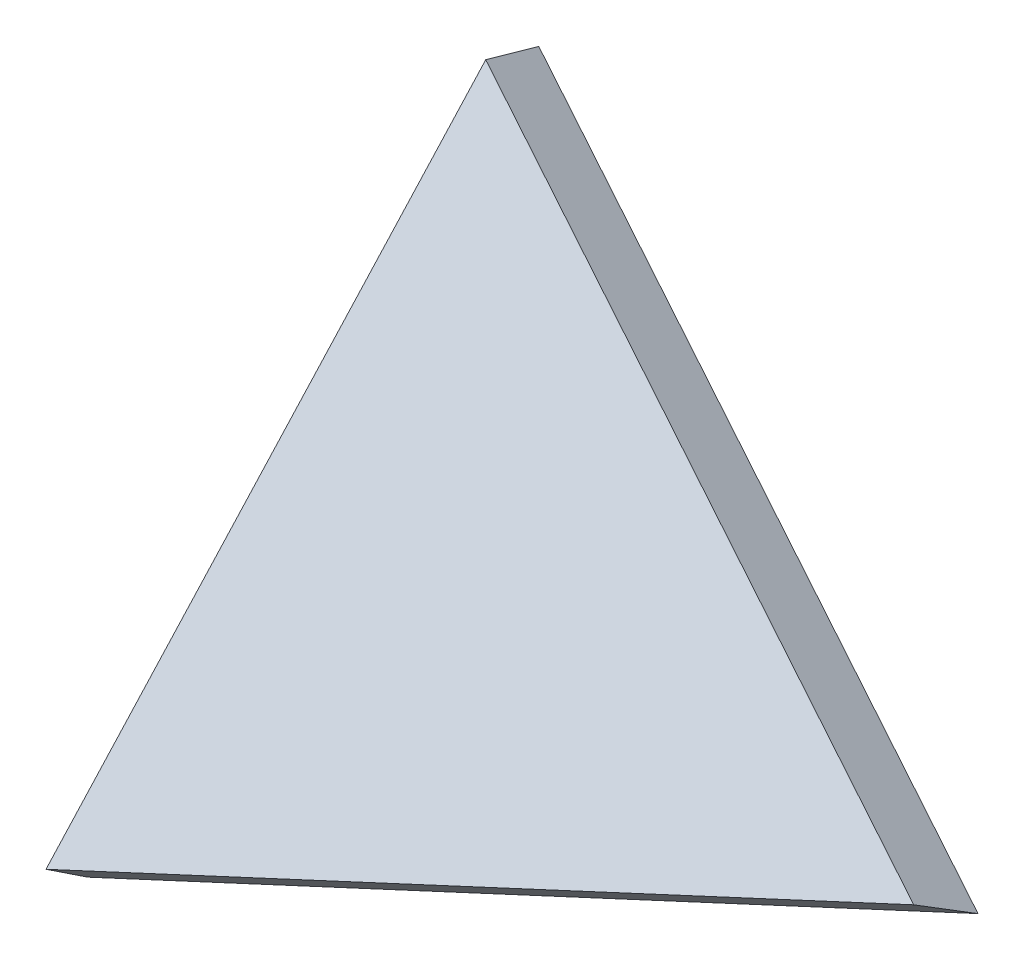
ISO-10303-21;
HEADER;
FILE_DESCRIPTION(('STEP AP214'),'2;1');
FILE_NAME('part.step','',(''),(''),'','','');
FILE_SCHEMA(('AUTOMOTIVE_DESIGN { 1 0 10303 214 1 1 1 1 }'));
ENDSEC;
DATA;
#1=APPLICATION_CONTEXT('core data for automotive mechanical design processes');
#2=APPLICATION_PROTOCOL_DEFINITION('international standard','automotive_design',2000,#1);
#3=PRODUCT_CONTEXT('',#1,'mechanical');
#4=PRODUCT('Part','Part','',(#3));
#5=PRODUCT_RELATED_PRODUCT_CATEGORY('part','',(#4));
#6=PRODUCT_DEFINITION_FORMATION('','',#4);
#7=PRODUCT_DEFINITION_CONTEXT('part definition',#1,'design');
#8=PRODUCT_DEFINITION('design','',#6,#7);
#9=PRODUCT_DEFINITION_SHAPE('','',#8);
#10=(LENGTH_UNIT() NAMED_UNIT(*) SI_UNIT(.MILLI.,.METRE.));
#11=(NAMED_UNIT(*) PLANE_ANGLE_UNIT() SI_UNIT($,.RADIAN.));
#12=(NAMED_UNIT(*) SI_UNIT($,.STERADIAN.) SOLID_ANGLE_UNIT());
#13=UNCERTAINTY_MEASURE_WITH_UNIT(LENGTH_MEASURE(1.E-05),#10,'distance_accuracy_value','');
#14=(GEOMETRIC_REPRESENTATION_CONTEXT(3) GLOBAL_UNCERTAINTY_ASSIGNED_CONTEXT((#13)) GLOBAL_UNIT_ASSIGNED_CONTEXT((#10,
#11,#12)) REPRESENTATION_CONTEXT('',''));
#15=CARTESIAN_POINT('',(0.,0.,0.));
#16=DIRECTION('',(0.,0.,1.));
#17=DIRECTION('',(1.,0.,0.));
#18=AXIS2_PLACEMENT_3D('',#15,#16,#17);
#19=CARTESIAN_POINT('',(1.64832448490546,203.403025611015,386.525464938519));
#20=DIRECTION('',(-0.00377380276404069,-0.465686766952991,-0.884941576318781));
#21=DIRECTION('',(0.,0.884947877872447,-0.465690083047785));
#22=AXIS2_PLACEMENT_3D('',#19,#20,#21);
#23=PLANE('',#22);
#24=DIRECTION('',(-0.844161253265809,0.475886304076224,-0.246827883508674));
#25=VECTOR('',#24,1.);
#26=CARTESIAN_POINT('',(-7635.13298924673,-5561.17680593782,3452.61290351664));
#27=LINE('',#26,#25);
#28=CARTESIAN_POINT('',(-6922.01558613949,-5963.18863012929,3661.1243207621));
#29=VERTEX_POINT('',#28);
#30=CARTESIAN_POINT('',(-7626.49227625021,-5566.04790960029,3455.13939817946));
#31=VERTEX_POINT('',#30);
#32=EDGE_CURVE('E70',#29,#31,#27,.T.);
#33=ORIENTED_EDGE('',*,*,#32,.T.);
#34=DIRECTION('',(-0.175952847890339,-0.870832024405516,0.459012179129346));
#35=VECTOR('',#34,1.);
#36=CARTESIAN_POINT('',(-7769.1836891903,-6272.26127008732,3827.381718676));
#37=LINE('',#36,#35);
#38=CARTESIAN_POINT('',(-7768.40823289946,-6268.42335453389,3825.35876828818));
#39=VERTEX_POINT('',#38);
#40=EDGE_CURVE('E42',#31,#39,#37,.T.);
#41=ORIENTED_EDGE('',*,*,#40,.T.);
#42=DIRECTION('',(0.92540805447083,0.333730064349569,-0.179566636293456));
#43=VECTOR('',#42,1.);
#44=CARTESIAN_POINT('',(-6910.74723442624,-5959.1249225311,3658.93780422602));
#45=LINE('',#44,#43);
#46=EDGE_CURVE('E84',#39,#29,#45,.T.);
#47=ORIENTED_EDGE('',*,*,#46,.T.);
#48=EDGE_LOOP('',(#33,#41,#47));
#49=FACE_BOUND('',#48,.T.);
#50=ADVANCED_FACE('F34',(#49),#23,.F.);
#51=CARTESIAN_POINT('',(1.38415829142263,170.804951924305,324.579554596205));
#52=DIRECTION('',(-0.00377380276404069,-0.465686766952991,-0.884941576318781));
#53=DIRECTION('',(0.,0.884947877872447,-0.465690083047785));
#54=AXIS2_PLACEMENT_3D('',#51,#52,#53);
#55=PLANE('',#54);
#56=DIRECTION('',(0.175952847890339,0.870832024405515,-0.459012179129346));
#57=VECTOR('',#56,1.);
#58=CARTESIAN_POINT('',(-7777.46207375673,-6309.60055399141,3767.9649729666));
#59=LINE('',#58,#57);
#60=CARTESIAN_POINT('',(-7777.46207375673,-6309.60055399141,3767.9649729666));
#61=VERTEX_POINT('',#60);
#62=CARTESIAN_POINT('',(-7631.82353450545,-5588.8011722917,3388.0344173179));
#63=VERTEX_POINT('',#62);
#64=EDGE_CURVE('E69',#61,#63,#59,.T.);
#65=ORIENTED_EDGE('',*,*,#64,.T.);
#66=DIRECTION('',(0.844161253265809,-0.475886304076224,0.246827883508674));
#67=VECTOR('',#66,1.);
#68=CARTESIAN_POINT('',(-7631.82353450545,-5588.8011722917,3388.0344173179));
#69=LINE('',#68,#67);
#70=CARTESIAN_POINT('',(-6908.86779008634,-5996.35924948522,3599.42250884076));
#71=VERTEX_POINT('',#70);
#72=EDGE_CURVE('E76',#63,#71,#69,.T.);
#73=ORIENTED_EDGE('',*,*,#72,.T.);
#74=DIRECTION('',(-0.92540805447083,-0.333730064349569,0.179566636293456));
#75=VECTOR('',#74,1.);
#76=CARTESIAN_POINT('',(-6908.86779008634,-5996.35924948522,3599.42250884076));
#77=LINE('',#76,#75);
#78=EDGE_CURVE('E78',#71,#61,#77,.T.);
#79=ORIENTED_EDGE('',*,*,#78,.T.);
#80=EDGE_LOOP('',(#65,#73,#79));
#81=FACE_BOUND('',#80,.T.);
#82=ADVANCED_FACE('F75',(#81),#55,.T.);
#83=CARTESIAN_POINT('',(-6908.86779008634,-5996.35924948522,3599.42250884076));
#84=DIRECTION('',(0.378026096772173,-0.779437047283776,0.499573977985988));
#85=DIRECTION('',(0.92540805447083,0.333730064349569,-0.179566636293456));
#86=AXIS2_PLACEMENT_3D('',#83,#84,#85);
#87=PLANE('',#86);
#88=ORIENTED_EDGE('',*,*,#46,.F.);
#89=DIRECTION('',(-0.127133835866622,-0.578209336767325,-0.805922422229913));
#90=VECTOR('',#89,1.);
#91=CARTESIAN_POINT('',(-7757.665476932,-6219.56490736553,3893.45887595588));
#92=LINE('',#91,#90);
#93=EDGE_CURVE('E11',#39,#61,#92,.T.);
#94=ORIENTED_EDGE('',*,*,#93,.T.);
#95=ORIENTED_EDGE('',*,*,#78,.F.);
#96=DIRECTION('',(-0.184463158995756,0.465382730877966,0.865674451958629));
#97=VECTOR('',#96,1.);
#98=CARTESIAN_POINT('',(-6908.86779008634,-5996.35924948522,3599.42250884076));
#99=LINE('',#98,#97);
#100=EDGE_CURVE('E82',#71,#29,#99,.T.);
#101=ORIENTED_EDGE('',*,*,#100,.T.);
#102=EDGE_LOOP('',(#88,#94,#95,#101));
#103=FACE_BOUND('',#102,.T.);
#104=ADVANCED_FACE('F90',(#103),#87,.T.);
#105=CARTESIAN_POINT('',(-7631.82353450545,-5588.8011722917,3388.03441731791));
#106=DIRECTION('',(0.534019349428608,0.786890137100933,-0.309236554386964));
#107=DIRECTION('',(-0.844161253265809,0.475886304076224,-0.246827883508674));
#108=AXIS2_PLACEMENT_3D('',#105,#106,#107);
#109=PLANE('',#108);
#110=ORIENTED_EDGE('',*,*,#72,.F.);
#111=DIRECTION('',(0.0750270601740891,0.32020778723846,0.944371702897478));
#112=VECTOR('',#111,1.);
#113=CARTESIAN_POINT('',(-7631.82353450545,-5588.8011722917,3388.03441731791));
#114=LINE('',#113,#112);
#115=EDGE_CURVE('E56',#63,#31,#114,.T.);
#116=ORIENTED_EDGE('',*,*,#115,.T.);
#117=ORIENTED_EDGE('',*,*,#32,.F.);
#118=ORIENTED_EDGE('',*,*,#100,.F.);
#119=EDGE_LOOP('',(#110,#116,#117,#118));
#120=FACE_BOUND('',#119,.T.);
#121=ADVANCED_FACE('F80',(#120),#109,.T.);
#122=CARTESIAN_POINT('',(-7777.46207375673,-6309.60055399141,3767.9649729666));
#123=DIRECTION('',(-0.979211129896471,0.20264010194284,0.00908582255340929));
#124=DIRECTION('',(-0.175952847890339,-0.870832024405515,0.459012179129346));
#125=AXIS2_PLACEMENT_3D('',#122,#123,#124);
#126=PLANE('',#125);
#127=ORIENTED_EDGE('',*,*,#93,.F.);
#128=ORIENTED_EDGE('',*,*,#40,.F.);
#129=ORIENTED_EDGE('',*,*,#115,.F.);
#130=ORIENTED_EDGE('',*,*,#64,.F.);
#131=EDGE_LOOP('',(#127,#128,#129,#130));
#132=FACE_BOUND('',#131,.T.);
#133=ADVANCED_FACE('F36',(#132),#126,.T.);
#134=CLOSED_SHELL('',(#50,#82,#104,#121,#133));
#135=MANIFOLD_SOLID_BREP('B2',#134);
#136=ADVANCED_BREP_SHAPE_REPRESENTATION('',(#18,#135),#14);
#137=SHAPE_DEFINITION_REPRESENTATION(#9,#136);
ENDSEC;
END-ISO-10303-21;
